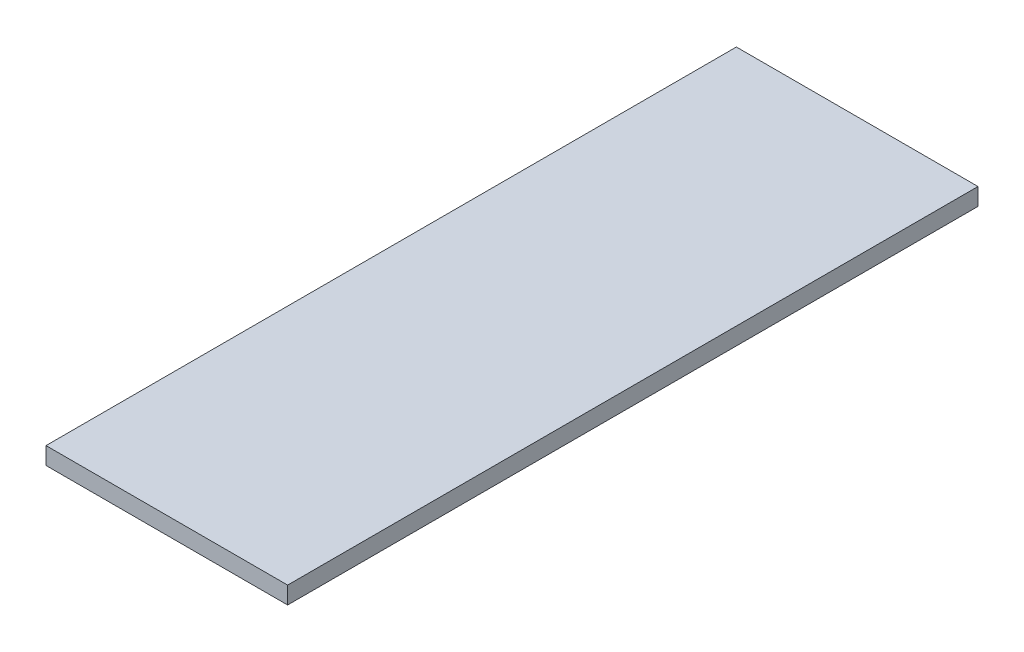
ISO-10303-21;
HEADER;
FILE_DESCRIPTION(('STEP AP214'),'2;1');
FILE_NAME('part.step','',(''),(''),'','','');
FILE_SCHEMA(('AUTOMOTIVE_DESIGN { 1 0 10303 214 1 1 1 1 }'));
ENDSEC;
DATA;
#1=APPLICATION_CONTEXT('core data for automotive mechanical design processes');
#2=APPLICATION_PROTOCOL_DEFINITION('international standard','automotive_design',2000,#1);
#3=PRODUCT_CONTEXT('',#1,'mechanical');
#4=PRODUCT('Part','Part','',(#3));
#5=PRODUCT_RELATED_PRODUCT_CATEGORY('part','',(#4));
#6=PRODUCT_DEFINITION_FORMATION('','',#4);
#7=PRODUCT_DEFINITION_CONTEXT('part definition',#1,'design');
#8=PRODUCT_DEFINITION('design','',#6,#7);
#9=PRODUCT_DEFINITION_SHAPE('','',#8);
#10=(LENGTH_UNIT() NAMED_UNIT(*) SI_UNIT(.MILLI.,.METRE.));
#11=(NAMED_UNIT(*) PLANE_ANGLE_UNIT() SI_UNIT($,.RADIAN.));
#12=(NAMED_UNIT(*) SI_UNIT($,.STERADIAN.) SOLID_ANGLE_UNIT());
#13=UNCERTAINTY_MEASURE_WITH_UNIT(LENGTH_MEASURE(1.E-05),#10,'distance_accuracy_value','');
#14=(GEOMETRIC_REPRESENTATION_CONTEXT(3) GLOBAL_UNCERTAINTY_ASSIGNED_CONTEXT((#13)) GLOBAL_UNIT_ASSIGNED_CONTEXT((#10,
#11,#12)) REPRESENTATION_CONTEXT('',''));
#15=CARTESIAN_POINT('',(0.,0.,0.));
#16=DIRECTION('',(0.,0.,1.));
#17=DIRECTION('',(1.,0.,0.));
#18=AXIS2_PLACEMENT_3D('',#15,#16,#17);
#19=CARTESIAN_POINT('',(16.2385321100916,5.,-100.45871559633));
#20=DIRECTION('',(1.,0.,0.));
#21=DIRECTION('',(0.,0.,-1.));
#22=AXIS2_PLACEMENT_3D('',#19,#20,#21);
#23=PLANE('',#22);
#24=DIRECTION('',(0.,0.,1.));
#25=VECTOR('',#24,1.);
#26=CARTESIAN_POINT('',(16.2385321100916,0.,-100.45871559633));
#27=LINE('',#26,#25);
#28=CARTESIAN_POINT('',(16.2385321100916,0.,-100.45871559633));
#29=VERTEX_POINT('',#28);
#30=CARTESIAN_POINT('',(16.2385321100917,0.,99.5412844036697));
#31=VERTEX_POINT('',#30);
#32=EDGE_CURVE('E96',#29,#31,#27,.T.);
#33=ORIENTED_EDGE('',*,*,#32,.T.);
#34=DIRECTION('',(0.,-1.,0.));
#35=VECTOR('',#34,1.);
#36=CARTESIAN_POINT('',(16.2385321100917,5.,99.5412844036697));
#37=LINE('',#36,#35);
#38=CARTESIAN_POINT('',(16.2385321100917,5.,99.5412844036697));
#39=VERTEX_POINT('',#38);
#40=EDGE_CURVE('E11',#39,#31,#37,.T.);
#41=ORIENTED_EDGE('',*,*,#40,.F.);
#42=DIRECTION('',(0.,0.,1.));
#43=VECTOR('',#42,1.);
#44=CARTESIAN_POINT('',(16.2385321100916,5.,-100.45871559633));
#45=LINE('',#44,#43);
#46=CARTESIAN_POINT('',(16.2385321100916,5.,-100.45871559633));
#47=VERTEX_POINT('',#46);
#48=EDGE_CURVE('E84',#47,#39,#45,.T.);
#49=ORIENTED_EDGE('',*,*,#48,.F.);
#50=DIRECTION('',(0.,-1.,0.));
#51=VECTOR('',#50,1.);
#52=CARTESIAN_POINT('',(16.2385321100916,5.,-100.45871559633));
#53=LINE('',#52,#51);
#54=EDGE_CURVE('E92',#47,#29,#53,.T.);
#55=ORIENTED_EDGE('',*,*,#54,.T.);
#56=EDGE_LOOP('',(#33,#41,#49,#55));
#57=FACE_BOUND('',#56,.T.);
#58=ADVANCED_FACE('F33',(#57),#23,.F.);
#59=CARTESIAN_POINT('',(16.2385321100917,5.,99.5412844036697));
#60=DIRECTION('',(0.,0.,-1.));
#61=DIRECTION('',(-1.,0.,0.));
#62=AXIS2_PLACEMENT_3D('',#59,#60,#61);
#63=PLANE('',#62);
#64=DIRECTION('',(1.,0.,0.));
#65=VECTOR('',#64,1.);
#66=CARTESIAN_POINT('',(16.2385321100917,0.,99.5412844036697));
#67=LINE('',#66,#65);
#68=CARTESIAN_POINT('',(86.2385321100916,0.,99.5412844036697));
#69=VERTEX_POINT('',#68);
#70=EDGE_CURVE('E88',#31,#69,#67,.T.);
#71=ORIENTED_EDGE('',*,*,#70,.T.);
#72=DIRECTION('',(0.,-1.,0.));
#73=VECTOR('',#72,1.);
#74=CARTESIAN_POINT('',(86.2385321100916,5.,99.5412844036697));
#75=LINE('',#74,#73);
#76=CARTESIAN_POINT('',(86.2385321100916,5.,99.5412844036697));
#77=VERTEX_POINT('',#76);
#78=EDGE_CURVE('E41',#77,#69,#75,.T.);
#79=ORIENTED_EDGE('',*,*,#78,.F.);
#80=DIRECTION('',(1.,0.,0.));
#81=VECTOR('',#80,1.);
#82=CARTESIAN_POINT('',(16.2385321100917,5.,99.5412844036697));
#83=LINE('',#82,#81);
#84=EDGE_CURVE('E79',#39,#77,#83,.T.);
#85=ORIENTED_EDGE('',*,*,#84,.F.);
#86=ORIENTED_EDGE('',*,*,#40,.T.);
#87=EDGE_LOOP('',(#71,#79,#85,#86));
#88=FACE_BOUND('',#87,.T.);
#89=ADVANCED_FACE('F87',(#88),#63,.F.);
#90=CARTESIAN_POINT('',(86.2385321100916,5.,-100.45871559633));
#91=DIRECTION('',(-1.,0.,0.));
#92=DIRECTION('',(0.,0.,1.));
#93=AXIS2_PLACEMENT_3D('',#90,#91,#92);
#94=PLANE('',#93);
#95=DIRECTION('',(0.,0.,-1.));
#96=VECTOR('',#95,1.);
#97=CARTESIAN_POINT('',(86.2385321100916,0.,-100.45871559633));
#98=LINE('',#97,#96);
#99=CARTESIAN_POINT('',(86.2385321100916,0.,-100.45871559633));
#100=VERTEX_POINT('',#99);
#101=EDGE_CURVE('E66',#69,#100,#98,.T.);
#102=ORIENTED_EDGE('',*,*,#101,.T.);
#103=DIRECTION('',(0.,-1.,0.));
#104=VECTOR('',#103,1.);
#105=CARTESIAN_POINT('',(86.2385321100916,5.,-100.45871559633));
#106=LINE('',#105,#104);
#107=CARTESIAN_POINT('',(86.2385321100916,5.,-100.45871559633));
#108=VERTEX_POINT('',#107);
#109=EDGE_CURVE('E89',#108,#100,#106,.T.);
#110=ORIENTED_EDGE('',*,*,#109,.F.);
#111=DIRECTION('',(0.,0.,-1.));
#112=VECTOR('',#111,1.);
#113=CARTESIAN_POINT('',(86.2385321100916,5.,-100.45871559633));
#114=LINE('',#113,#112);
#115=EDGE_CURVE('E82',#77,#108,#114,.T.);
#116=ORIENTED_EDGE('',*,*,#115,.F.);
#117=ORIENTED_EDGE('',*,*,#78,.T.);
#118=EDGE_LOOP('',(#102,#110,#116,#117));
#119=FACE_BOUND('',#118,.T.);
#120=ADVANCED_FACE('F90',(#119),#94,.F.);
#121=CARTESIAN_POINT('',(16.2385321100916,5.,-100.45871559633));
#122=DIRECTION('',(0.,0.,1.));
#123=DIRECTION('',(1.,0.,0.));
#124=AXIS2_PLACEMENT_3D('',#121,#122,#123);
#125=PLANE('',#124);
#126=DIRECTION('',(-1.,0.,0.));
#127=VECTOR('',#126,1.);
#128=CARTESIAN_POINT('',(16.2385321100916,0.,-100.45871559633));
#129=LINE('',#128,#127);
#130=EDGE_CURVE('E72',#100,#29,#129,.T.);
#131=ORIENTED_EDGE('',*,*,#130,.T.);
#132=ORIENTED_EDGE('',*,*,#54,.F.);
#133=DIRECTION('',(-1.,0.,0.));
#134=VECTOR('',#133,1.);
#135=CARTESIAN_POINT('',(16.2385321100916,5.,-100.45871559633));
#136=LINE('',#135,#134);
#137=EDGE_CURVE('E49',#108,#47,#136,.T.);
#138=ORIENTED_EDGE('',*,*,#137,.F.);
#139=ORIENTED_EDGE('',*,*,#109,.T.);
#140=EDGE_LOOP('',(#131,#132,#138,#139));
#141=FACE_BOUND('',#140,.T.);
#142=ADVANCED_FACE('F103',(#141),#125,.F.);
#143=CARTESIAN_POINT('',(0.,5.,0.));
#144=DIRECTION('',(0.,1.,0.));
#145=DIRECTION('',(0.,0.,1.));
#146=AXIS2_PLACEMENT_3D('',#143,#144,#145);
#147=PLANE('',#146);
#148=ORIENTED_EDGE('',*,*,#48,.T.);
#149=ORIENTED_EDGE('',*,*,#84,.T.);
#150=ORIENTED_EDGE('',*,*,#115,.T.);
#151=ORIENTED_EDGE('',*,*,#137,.T.);
#152=EDGE_LOOP('',(#148,#149,#150,#151));
#153=FACE_BOUND('',#152,.T.);
#154=ADVANCED_FACE('F80',(#153),#147,.T.);
#155=CARTESIAN_POINT('',(0.,0.,0.));
#156=DIRECTION('',(0.,1.,0.));
#157=DIRECTION('',(0.,0.,1.));
#158=AXIS2_PLACEMENT_3D('',#155,#156,#157);
#159=PLANE('',#158);
#160=ORIENTED_EDGE('',*,*,#32,.F.);
#161=ORIENTED_EDGE('',*,*,#130,.F.);
#162=ORIENTED_EDGE('',*,*,#101,.F.);
#163=ORIENTED_EDGE('',*,*,#70,.F.);
#164=EDGE_LOOP('',(#160,#161,#162,#163));
#165=FACE_BOUND('',#164,.T.);
#166=ADVANCED_FACE('F106',(#165),#159,.F.);
#167=CLOSED_SHELL('',(#58,#89,#120,#142,#154,#166));
#168=MANIFOLD_SOLID_BREP('B2',#167);
#169=ADVANCED_BREP_SHAPE_REPRESENTATION('',(#18,#168),#14);
#170=SHAPE_DEFINITION_REPRESENTATION(#9,#169);
ENDSEC;
END-ISO-10303-21;
